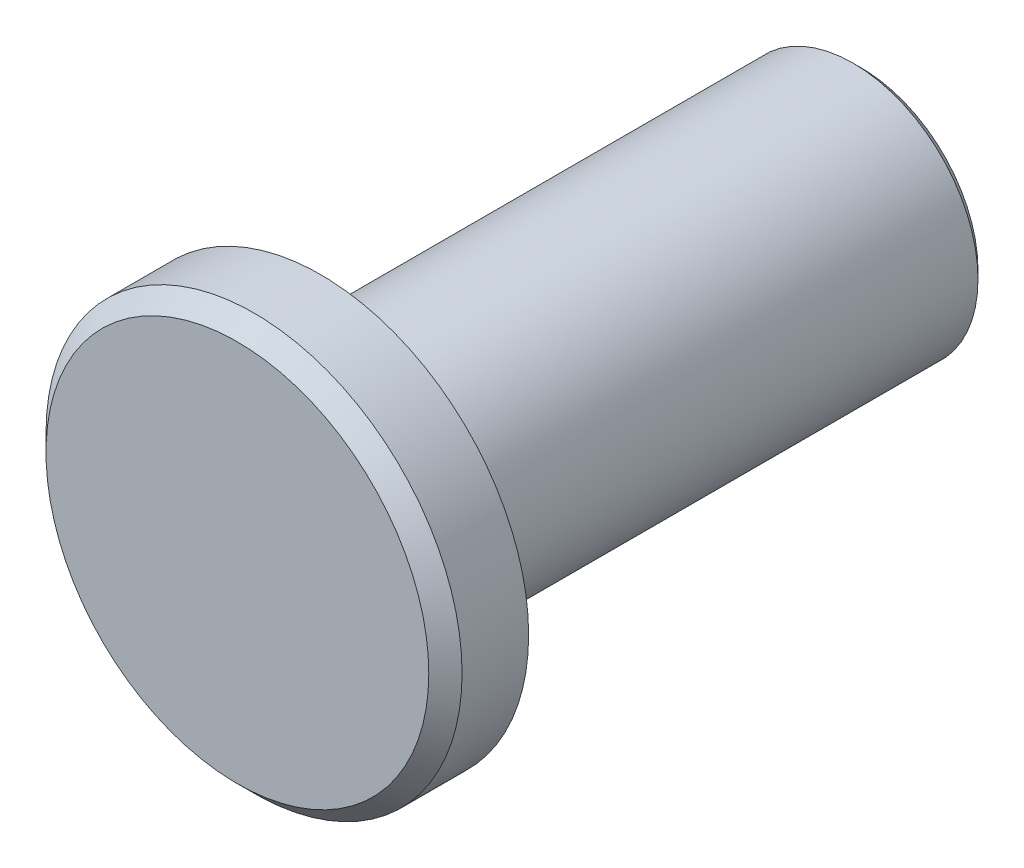
ISO-10303-21;
HEADER;
FILE_DESCRIPTION(('STEP AP214'),'2;1');
FILE_NAME('part.step','',(''),(''),'','','');
FILE_SCHEMA(('AUTOMOTIVE_DESIGN { 1 0 10303 214 1 1 1 1 }'));
ENDSEC;
DATA;
#1=APPLICATION_CONTEXT('core data for automotive mechanical design processes');
#2=APPLICATION_PROTOCOL_DEFINITION('international standard','automotive_design',2000,#1);
#3=PRODUCT_CONTEXT('',#1,'mechanical');
#4=PRODUCT('Part','Part','',(#3));
#5=PRODUCT_RELATED_PRODUCT_CATEGORY('part','',(#4));
#6=PRODUCT_DEFINITION_FORMATION('','',#4);
#7=PRODUCT_DEFINITION_CONTEXT('part definition',#1,'design');
#8=PRODUCT_DEFINITION('design','',#6,#7);
#9=PRODUCT_DEFINITION_SHAPE('','',#8);
#10=(LENGTH_UNIT() NAMED_UNIT(*) SI_UNIT(.MILLI.,.METRE.));
#11=(NAMED_UNIT(*) PLANE_ANGLE_UNIT() SI_UNIT($,.RADIAN.));
#12=(NAMED_UNIT(*) SI_UNIT($,.STERADIAN.) SOLID_ANGLE_UNIT());
#13=UNCERTAINTY_MEASURE_WITH_UNIT(LENGTH_MEASURE(1.E-05),#10,'distance_accuracy_value','');
#14=(GEOMETRIC_REPRESENTATION_CONTEXT(3) GLOBAL_UNCERTAINTY_ASSIGNED_CONTEXT((#13)) GLOBAL_UNIT_ASSIGNED_CONTEXT((#10,
#11,#12)) REPRESENTATION_CONTEXT('',''));
#15=CARTESIAN_POINT('',(0.,0.,0.));
#16=DIRECTION('',(0.,0.,1.));
#17=DIRECTION('',(1.,0.,0.));
#18=AXIS2_PLACEMENT_3D('',#15,#16,#17);
#19=CARTESIAN_POINT('',(0.,0.,6.5));
#20=DIRECTION('',(0.,0.,-1.));
#21=DIRECTION('',(-1.,0.,0.));
#22=AXIS2_PLACEMENT_3D('',#19,#20,#21);
#23=CYLINDRICAL_SURFACE('',#22,1.5);
#24=CARTESIAN_POINT('',(0.,0.,0.100000000000005));
#25=DIRECTION('',(0.,0.,1.));
#26=DIRECTION('',(1.,0.,0.));
#27=AXIS2_PLACEMENT_3D('',#24,#25,#26);
#28=CIRCLE('',#27,1.5);
#29=CARTESIAN_POINT('',(1.5,0.,0.100000000000005));
#30=VERTEX_POINT('',#29);
#31=EDGE_CURVE('E63',#30,#30,#28,.T.);
#32=ORIENTED_EDGE('',*,*,#31,.T.);
#33=EDGE_LOOP('',(#32));
#34=FACE_BOUND('',#33,.T.);
#35=CARTESIAN_POINT('',(0.,0.,6.5));
#36=DIRECTION('',(0.,0.,1.));
#37=DIRECTION('',(1.,0.,0.));
#38=AXIS2_PLACEMENT_3D('',#35,#36,#37);
#39=CIRCLE('',#38,1.5);
#40=CARTESIAN_POINT('',(1.5,0.,6.5));
#41=VERTEX_POINT('',#40);
#42=EDGE_CURVE('E69',#41,#41,#39,.T.);
#43=ORIENTED_EDGE('',*,*,#42,.F.);
#44=EDGE_LOOP('',(#43));
#45=FACE_BOUND('',#44,.T.);
#46=ADVANCED_FACE('F42',(#34,#45),#23,.T.);
#47=CARTESIAN_POINT('',(0.,0.,0.));
#48=DIRECTION('',(0.,0.,1.));
#49=DIRECTION('',(1.,0.,0.));
#50=AXIS2_PLACEMENT_3D('',#47,#48,#49);
#51=PLANE('',#50);
#52=CARTESIAN_POINT('',(0.,0.,0.));
#53=DIRECTION('',(0.,0.,1.));
#54=DIRECTION('',(1.,0.,0.));
#55=AXIS2_PLACEMENT_3D('',#52,#53,#54);
#56=CIRCLE('',#55,1.4);
#57=CARTESIAN_POINT('',(1.4,0.,0.));
#58=VERTEX_POINT('',#57);
#59=EDGE_CURVE('E57',#58,#58,#56,.F.);
#60=ORIENTED_EDGE('',*,*,#59,.T.);
#61=EDGE_LOOP('',(#60));
#62=FACE_BOUND('',#61,.T.);
#63=ADVANCED_FACE('F94',(#62),#51,.F.);
#64=CARTESIAN_POINT('',(0.,0.,0.100000000000005));
#65=DIRECTION('',(0.,0.,1.));
#66=DIRECTION('',(1.,0.,0.));
#67=AXIS2_PLACEMENT_3D('',#64,#65,#66);
#68=CONICAL_SURFACE('',#67,1.5,0.785398163397446);
#69=ORIENTED_EDGE('',*,*,#59,.F.);
#70=EDGE_LOOP('',(#69));
#71=FACE_BOUND('',#70,.T.);
#72=ORIENTED_EDGE('',*,*,#31,.F.);
#73=EDGE_LOOP('',(#72));
#74=FACE_BOUND('',#73,.T.);
#75=ADVANCED_FACE('F100',(#71,#74),#68,.T.);
#76=CARTESIAN_POINT('',(0.,0.,7.5));
#77=DIRECTION('',(0.,0.,-1.));
#78=DIRECTION('',(-1.,0.,0.));
#79=AXIS2_PLACEMENT_3D('',#76,#77,#78);
#80=CYLINDRICAL_SURFACE('',#79,2.5);
#81=CARTESIAN_POINT('',(0.,0.,7.3));
#82=DIRECTION('',(0.,0.,1.));
#83=DIRECTION('',(1.,0.,0.));
#84=AXIS2_PLACEMENT_3D('',#81,#82,#83);
#85=CIRCLE('',#84,2.5);
#86=CARTESIAN_POINT('',(2.5,0.,7.3));
#87=VERTEX_POINT('',#86);
#88=EDGE_CURVE('E10',#87,#87,#85,.F.);
#89=ORIENTED_EDGE('',*,*,#88,.T.);
#90=EDGE_LOOP('',(#89));
#91=FACE_BOUND('',#90,.T.);
#92=CARTESIAN_POINT('',(0.,0.,6.5));
#93=DIRECTION('',(0.,0.,1.));
#94=DIRECTION('',(1.,0.,0.));
#95=AXIS2_PLACEMENT_3D('',#92,#93,#94);
#96=CIRCLE('',#95,2.5);
#97=CARTESIAN_POINT('',(2.5,0.,6.5));
#98=VERTEX_POINT('',#97);
#99=EDGE_CURVE('E73',#98,#98,#96,.T.);
#100=ORIENTED_EDGE('',*,*,#99,.T.);
#101=EDGE_LOOP('',(#100));
#102=FACE_BOUND('',#101,.T.);
#103=ADVANCED_FACE('F79',(#91,#102),#80,.T.);
#104=CARTESIAN_POINT('',(0.,0.,7.5));
#105=DIRECTION('',(0.,0.,1.));
#106=DIRECTION('',(1.,0.,0.));
#107=AXIS2_PLACEMENT_3D('',#104,#105,#106);
#108=PLANE('',#107);
#109=CARTESIAN_POINT('',(0.,0.,7.5));
#110=DIRECTION('',(0.,0.,1.));
#111=DIRECTION('',(1.,0.,0.));
#112=AXIS2_PLACEMENT_3D('',#109,#110,#111);
#113=CIRCLE('',#112,2.3);
#114=CARTESIAN_POINT('',(2.3,0.,7.5));
#115=VERTEX_POINT('',#114);
#116=EDGE_CURVE('E51',#115,#115,#113,.T.);
#117=ORIENTED_EDGE('',*,*,#116,.T.);
#118=EDGE_LOOP('',(#117));
#119=FACE_BOUND('',#118,.T.);
#120=ADVANCED_FACE('F83',(#119),#108,.T.);
#121=CARTESIAN_POINT('',(0.,0.,6.5));
#122=DIRECTION('',(0.,0.,1.));
#123=DIRECTION('',(1.,0.,0.));
#124=AXIS2_PLACEMENT_3D('',#121,#122,#123);
#125=PLANE('',#124);
#126=ORIENTED_EDGE('',*,*,#42,.T.);
#127=EDGE_LOOP('',(#126));
#128=FACE_BOUND('',#127,.T.);
#129=ORIENTED_EDGE('',*,*,#99,.F.);
#130=EDGE_LOOP('',(#129));
#131=FACE_BOUND('',#130,.T.);
#132=ADVANCED_FACE('F81',(#128,#131),#125,.F.);
#133=CARTESIAN_POINT('',(0.,0.,7.5));
#134=DIRECTION('',(0.,0.,-1.));
#135=DIRECTION('',(-1.,0.,0.));
#136=AXIS2_PLACEMENT_3D('',#133,#134,#135);
#137=CONICAL_SURFACE('',#136,2.3,0.785398163397447);
#138=ORIENTED_EDGE('',*,*,#88,.F.);
#139=EDGE_LOOP('',(#138));
#140=FACE_BOUND('',#139,.T.);
#141=ORIENTED_EDGE('',*,*,#116,.F.);
#142=EDGE_LOOP('',(#141));
#143=FACE_BOUND('',#142,.T.);
#144=ADVANCED_FACE('F45',(#140,#143),#137,.T.);
#145=CLOSED_SHELL('',(#46,#63,#75,#103,#120,#132,#144));
#146=MANIFOLD_SOLID_BREP('B2',#145);
#147=ADVANCED_BREP_SHAPE_REPRESENTATION('',(#18,#146),#14);
#148=SHAPE_DEFINITION_REPRESENTATION(#9,#147);
ENDSEC;
END-ISO-10303-21;
